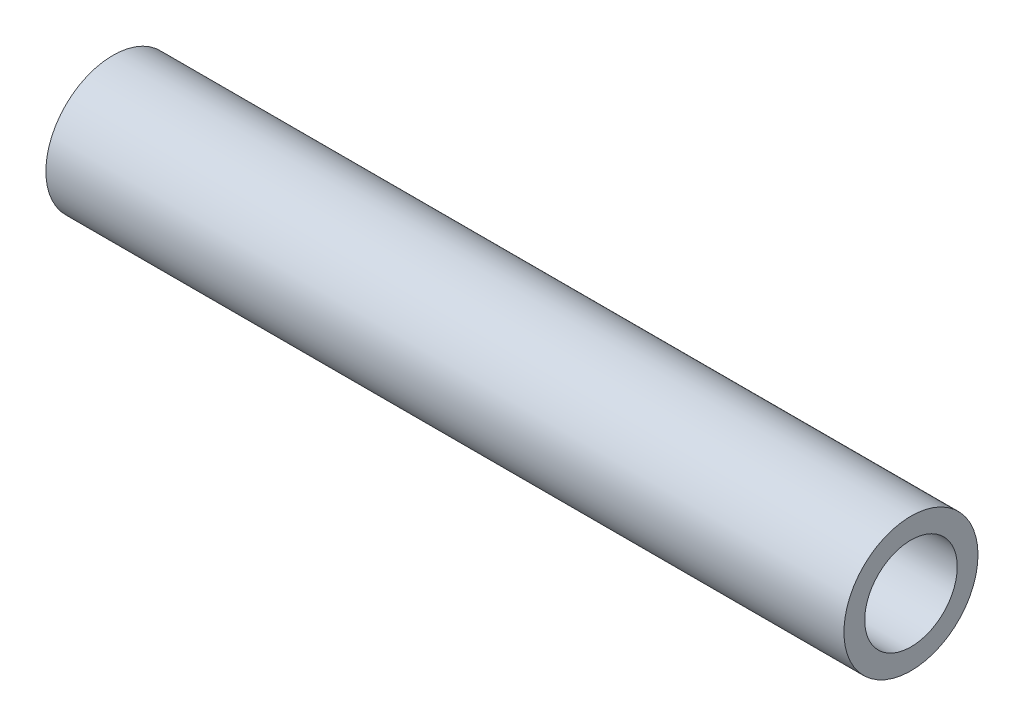
ISO-10303-21;
HEADER;
FILE_DESCRIPTION(('STEP AP214'),'2;1');
FILE_NAME('part.step','',(''),(''),'','','');
FILE_SCHEMA(('AUTOMOTIVE_DESIGN { 1 0 10303 214 1 1 1 1 }'));
ENDSEC;
DATA;
#1=APPLICATION_CONTEXT('core data for automotive mechanical design processes');
#2=APPLICATION_PROTOCOL_DEFINITION('international standard','automotive_design',2000,#1);
#3=PRODUCT_CONTEXT('',#1,'mechanical');
#4=PRODUCT('Part','Part','',(#3));
#5=PRODUCT_RELATED_PRODUCT_CATEGORY('part','',(#4));
#6=PRODUCT_DEFINITION_FORMATION('','',#4);
#7=PRODUCT_DEFINITION_CONTEXT('part definition',#1,'design');
#8=PRODUCT_DEFINITION('design','',#6,#7);
#9=PRODUCT_DEFINITION_SHAPE('','',#8);
#10=(LENGTH_UNIT() NAMED_UNIT(*) SI_UNIT(.MILLI.,.METRE.));
#11=(NAMED_UNIT(*) PLANE_ANGLE_UNIT() SI_UNIT($,.RADIAN.));
#12=(NAMED_UNIT(*) SI_UNIT($,.STERADIAN.) SOLID_ANGLE_UNIT());
#13=UNCERTAINTY_MEASURE_WITH_UNIT(LENGTH_MEASURE(1.E-05),#10,'distance_accuracy_value','');
#14=(GEOMETRIC_REPRESENTATION_CONTEXT(3) GLOBAL_UNCERTAINTY_ASSIGNED_CONTEXT((#13)) GLOBAL_UNIT_ASSIGNED_CONTEXT((#10,
#11,#12)) REPRESENTATION_CONTEXT('',''));
#15=CARTESIAN_POINT('',(0.,0.,0.));
#16=DIRECTION('',(0.,0.,1.));
#17=DIRECTION('',(1.,0.,0.));
#18=AXIS2_PLACEMENT_3D('',#15,#16,#17);
#19=CARTESIAN_POINT('',(-127.,0.,0.));
#20=DIRECTION('',(1.,0.,0.));
#21=DIRECTION('',(0.,0.,-1.));
#22=AXIS2_PLACEMENT_3D('',#19,#20,#21);
#23=CYLINDRICAL_SURFACE('',#22,10.668);
#24=CARTESIAN_POINT('',(-127.,0.,0.));
#25=DIRECTION('',(1.,0.,0.));
#26=DIRECTION('',(0.,0.,-1.));
#27=AXIS2_PLACEMENT_3D('',#24,#25,#26);
#28=CIRCLE('',#27,10.668);
#29=CARTESIAN_POINT('',(-127.,0.,-10.668));
#30=VERTEX_POINT('',#29);
#31=EDGE_CURVE('E10',#30,#30,#28,.T.);
#32=ORIENTED_EDGE('',*,*,#31,.T.);
#33=EDGE_LOOP('',(#32));
#34=FACE_BOUND('',#33,.T.);
#35=CARTESIAN_POINT('',(0.,0.,0.));
#36=DIRECTION('',(1.,0.,0.));
#37=DIRECTION('',(0.,0.,-1.));
#38=AXIS2_PLACEMENT_3D('',#35,#36,#37);
#39=CIRCLE('',#38,10.668);
#40=CARTESIAN_POINT('',(0.,0.,-10.668));
#41=VERTEX_POINT('',#40);
#42=EDGE_CURVE('E34',#41,#41,#39,.T.);
#43=ORIENTED_EDGE('',*,*,#42,.F.);
#44=EDGE_LOOP('',(#43));
#45=FACE_BOUND('',#44,.T.);
#46=ADVANCED_FACE('F31',(#34,#45),#23,.T.);
#47=CARTESIAN_POINT('',(-127.,0.,0.));
#48=DIRECTION('',(1.,0.,0.));
#49=DIRECTION('',(0.,0.,-1.));
#50=AXIS2_PLACEMENT_3D('',#47,#48,#49);
#51=PLANE('',#50);
#52=CARTESIAN_POINT('',(-127.,0.,0.));
#53=DIRECTION('',(1.,0.,0.));
#54=DIRECTION('',(0.,0.,-1.));
#55=AXIS2_PLACEMENT_3D('',#52,#53,#54);
#56=CIRCLE('',#55,7.366);
#57=CARTESIAN_POINT('',(-127.,0.,-7.366));
#58=VERTEX_POINT('',#57);
#59=EDGE_CURVE('E41',#58,#58,#56,.T.);
#60=ORIENTED_EDGE('',*,*,#59,.T.);
#61=EDGE_LOOP('',(#60));
#62=FACE_BOUND('',#61,.T.);
#63=ORIENTED_EDGE('',*,*,#31,.F.);
#64=EDGE_LOOP('',(#63));
#65=FACE_BOUND('',#64,.T.);
#66=ADVANCED_FACE('F49',(#62,#65),#51,.F.);
#67=CARTESIAN_POINT('',(0.,0.,0.));
#68=DIRECTION('',(1.,0.,0.));
#69=DIRECTION('',(0.,0.,-1.));
#70=AXIS2_PLACEMENT_3D('',#67,#68,#69);
#71=PLANE('',#70);
#72=CARTESIAN_POINT('',(0.,0.,0.));
#73=DIRECTION('',(1.,0.,0.));
#74=DIRECTION('',(0.,0.,-1.));
#75=AXIS2_PLACEMENT_3D('',#72,#73,#74);
#76=CIRCLE('',#75,7.366);
#77=CARTESIAN_POINT('',(0.,0.,-7.366));
#78=VERTEX_POINT('',#77);
#79=EDGE_CURVE('E43',#78,#78,#76,.T.);
#80=ORIENTED_EDGE('',*,*,#79,.F.);
#81=EDGE_LOOP('',(#80));
#82=FACE_BOUND('',#81,.T.);
#83=ORIENTED_EDGE('',*,*,#42,.T.);
#84=EDGE_LOOP('',(#83));
#85=FACE_BOUND('',#84,.T.);
#86=ADVANCED_FACE('F55',(#82,#85),#71,.T.);
#87=CARTESIAN_POINT('',(-127.,0.,0.));
#88=DIRECTION('',(1.,0.,0.));
#89=DIRECTION('',(0.,0.,-1.));
#90=AXIS2_PLACEMENT_3D('',#87,#88,#89);
#91=CYLINDRICAL_SURFACE('',#90,7.366);
#92=ORIENTED_EDGE('',*,*,#59,.F.);
#93=EDGE_LOOP('',(#92));
#94=FACE_BOUND('',#93,.T.);
#95=ORIENTED_EDGE('',*,*,#79,.T.);
#96=EDGE_LOOP('',(#95));
#97=FACE_BOUND('',#96,.T.);
#98=ADVANCED_FACE('F52',(#94,#97),#91,.F.);
#99=CLOSED_SHELL('',(#46,#66,#86,#98));
#100=MANIFOLD_SOLID_BREP('B2',#99);
#101=ADVANCED_BREP_SHAPE_REPRESENTATION('',(#18,#100),#14);
#102=SHAPE_DEFINITION_REPRESENTATION(#9,#101);
ENDSEC;
END-ISO-10303-21;
